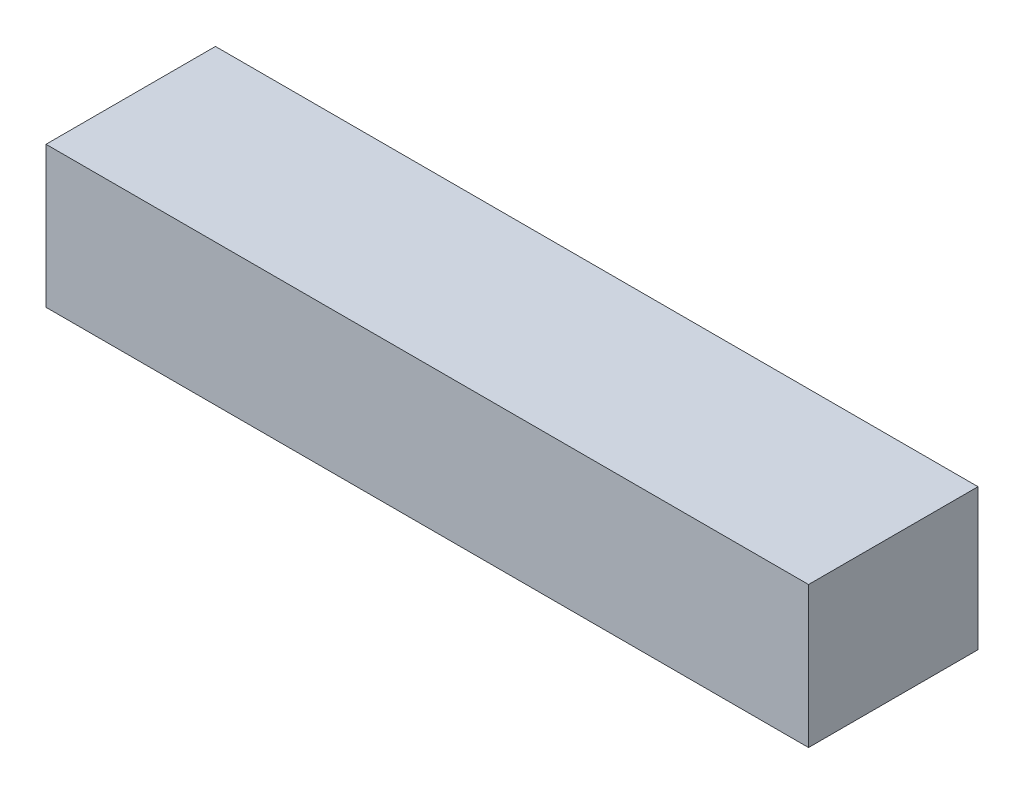
ISO-10303-21;
HEADER;
FILE_DESCRIPTION(('STEP AP214'),'2;1');
FILE_NAME('part.step','',(''),(''),'','','');
FILE_SCHEMA(('AUTOMOTIVE_DESIGN { 1 0 10303 214 1 1 1 1 }'));
ENDSEC;
DATA;
#1=APPLICATION_CONTEXT('core data for automotive mechanical design processes');
#2=APPLICATION_PROTOCOL_DEFINITION('international standard','automotive_design',2000,#1);
#3=PRODUCT_CONTEXT('',#1,'mechanical');
#4=PRODUCT('Part','Part','',(#3));
#5=PRODUCT_RELATED_PRODUCT_CATEGORY('part','',(#4));
#6=PRODUCT_DEFINITION_FORMATION('','',#4);
#7=PRODUCT_DEFINITION_CONTEXT('part definition',#1,'design');
#8=PRODUCT_DEFINITION('design','',#6,#7);
#9=PRODUCT_DEFINITION_SHAPE('','',#8);
#10=(LENGTH_UNIT() NAMED_UNIT(*) SI_UNIT(.MILLI.,.METRE.));
#11=(NAMED_UNIT(*) PLANE_ANGLE_UNIT() SI_UNIT($,.RADIAN.));
#12=(NAMED_UNIT(*) SI_UNIT($,.STERADIAN.) SOLID_ANGLE_UNIT());
#13=UNCERTAINTY_MEASURE_WITH_UNIT(LENGTH_MEASURE(1.E-05),#10,'distance_accuracy_value','');
#14=(GEOMETRIC_REPRESENTATION_CONTEXT(3) GLOBAL_UNCERTAINTY_ASSIGNED_CONTEXT((#13)) GLOBAL_UNIT_ASSIGNED_CONTEXT((#10,
#11,#12)) REPRESENTATION_CONTEXT('',''));
#15=CARTESIAN_POINT('',(0.,0.,0.));
#16=DIRECTION('',(0.,0.,1.));
#17=DIRECTION('',(1.,0.,0.));
#18=AXIS2_PLACEMENT_3D('',#15,#16,#17);
#19=CARTESIAN_POINT('',(0.,5.,0.));
#20=DIRECTION('',(1.,0.,0.));
#21=DIRECTION('',(0.,0.,-1.));
#22=AXIS2_PLACEMENT_3D('',#19,#20,#21);
#23=PLANE('',#22);
#24=DIRECTION('',(0.,0.,1.));
#25=VECTOR('',#24,1.);
#26=CARTESIAN_POINT('',(0.,0.,0.));
#27=LINE('',#26,#25);
#28=CARTESIAN_POINT('',(0.,0.,0.));
#29=VERTEX_POINT('',#28);
#30=CARTESIAN_POINT('',(0.,0.,6.));
#31=VERTEX_POINT('',#30);
#32=EDGE_CURVE('E100',#29,#31,#27,.T.);
#33=ORIENTED_EDGE('',*,*,#32,.T.);
#34=DIRECTION('',(0.,-1.,0.));
#35=VECTOR('',#34,1.);
#36=CARTESIAN_POINT('',(0.,5.,6.));
#37=LINE('',#36,#35);
#38=CARTESIAN_POINT('',(0.,5.,6.));
#39=VERTEX_POINT('',#38);
#40=EDGE_CURVE('E11',#39,#31,#37,.T.);
#41=ORIENTED_EDGE('',*,*,#40,.F.);
#42=DIRECTION('',(0.,0.,1.));
#43=VECTOR('',#42,1.);
#44=CARTESIAN_POINT('',(0.,5.,0.));
#45=LINE('',#44,#43);
#46=CARTESIAN_POINT('',(0.,5.,0.));
#47=VERTEX_POINT('',#46);
#48=EDGE_CURVE('E88',#47,#39,#45,.T.);
#49=ORIENTED_EDGE('',*,*,#48,.F.);
#50=DIRECTION('',(0.,-1.,0.));
#51=VECTOR('',#50,1.);
#52=CARTESIAN_POINT('',(0.,5.,0.));
#53=LINE('',#52,#51);
#54=EDGE_CURVE('E96',#47,#29,#53,.T.);
#55=ORIENTED_EDGE('',*,*,#54,.T.);
#56=EDGE_LOOP('',(#33,#41,#49,#55));
#57=FACE_BOUND('',#56,.T.);
#58=ADVANCED_FACE('F37',(#57),#23,.F.);
#59=CARTESIAN_POINT('',(0.,5.,6.));
#60=DIRECTION('',(0.,0.,-1.));
#61=DIRECTION('',(-1.,0.,0.));
#62=AXIS2_PLACEMENT_3D('',#59,#60,#61);
#63=PLANE('',#62);
#64=DIRECTION('',(1.,0.,0.));
#65=VECTOR('',#64,1.);
#66=CARTESIAN_POINT('',(0.,0.,6.));
#67=LINE('',#66,#65);
#68=CARTESIAN_POINT('',(27.,0.,6.));
#69=VERTEX_POINT('',#68);
#70=EDGE_CURVE('E92',#31,#69,#67,.T.);
#71=ORIENTED_EDGE('',*,*,#70,.T.);
#72=DIRECTION('',(0.,-1.,0.));
#73=VECTOR('',#72,1.);
#74=CARTESIAN_POINT('',(27.,5.,6.));
#75=LINE('',#74,#73);
#76=CARTESIAN_POINT('',(27.,5.,6.));
#77=VERTEX_POINT('',#76);
#78=EDGE_CURVE('E45',#77,#69,#75,.T.);
#79=ORIENTED_EDGE('',*,*,#78,.F.);
#80=DIRECTION('',(1.,0.,0.));
#81=VECTOR('',#80,1.);
#82=CARTESIAN_POINT('',(0.,5.,6.));
#83=LINE('',#82,#81);
#84=EDGE_CURVE('E83',#39,#77,#83,.T.);
#85=ORIENTED_EDGE('',*,*,#84,.F.);
#86=ORIENTED_EDGE('',*,*,#40,.T.);
#87=EDGE_LOOP('',(#71,#79,#85,#86));
#88=FACE_BOUND('',#87,.T.);
#89=ADVANCED_FACE('F91',(#88),#63,.F.);
#90=CARTESIAN_POINT('',(27.,5.,0.));
#91=DIRECTION('',(-1.,0.,0.));
#92=DIRECTION('',(0.,0.,1.));
#93=AXIS2_PLACEMENT_3D('',#90,#91,#92);
#94=PLANE('',#93);
#95=DIRECTION('',(0.,0.,-1.));
#96=VECTOR('',#95,1.);
#97=CARTESIAN_POINT('',(27.,0.,0.));
#98=LINE('',#97,#96);
#99=CARTESIAN_POINT('',(27.,0.,0.));
#100=VERTEX_POINT('',#99);
#101=EDGE_CURVE('E70',#69,#100,#98,.T.);
#102=ORIENTED_EDGE('',*,*,#101,.T.);
#103=DIRECTION('',(0.,-1.,0.));
#104=VECTOR('',#103,1.);
#105=CARTESIAN_POINT('',(27.,5.,0.));
#106=LINE('',#105,#104);
#107=CARTESIAN_POINT('',(27.,5.,0.));
#108=VERTEX_POINT('',#107);
#109=EDGE_CURVE('E93',#108,#100,#106,.T.);
#110=ORIENTED_EDGE('',*,*,#109,.F.);
#111=DIRECTION('',(0.,0.,-1.));
#112=VECTOR('',#111,1.);
#113=CARTESIAN_POINT('',(27.,5.,0.));
#114=LINE('',#113,#112);
#115=EDGE_CURVE('E86',#77,#108,#114,.T.);
#116=ORIENTED_EDGE('',*,*,#115,.F.);
#117=ORIENTED_EDGE('',*,*,#78,.T.);
#118=EDGE_LOOP('',(#102,#110,#116,#117));
#119=FACE_BOUND('',#118,.T.);
#120=ADVANCED_FACE('F94',(#119),#94,.F.);
#121=CARTESIAN_POINT('',(0.,5.,0.));
#122=DIRECTION('',(0.,0.,1.));
#123=DIRECTION('',(1.,0.,0.));
#124=AXIS2_PLACEMENT_3D('',#121,#122,#123);
#125=PLANE('',#124);
#126=DIRECTION('',(-1.,0.,0.));
#127=VECTOR('',#126,1.);
#128=CARTESIAN_POINT('',(0.,0.,0.));
#129=LINE('',#128,#127);
#130=EDGE_CURVE('E76',#100,#29,#129,.T.);
#131=ORIENTED_EDGE('',*,*,#130,.T.);
#132=ORIENTED_EDGE('',*,*,#54,.F.);
#133=DIRECTION('',(-1.,0.,0.));
#134=VECTOR('',#133,1.);
#135=CARTESIAN_POINT('',(0.,5.,0.));
#136=LINE('',#135,#134);
#137=EDGE_CURVE('E53',#108,#47,#136,.T.);
#138=ORIENTED_EDGE('',*,*,#137,.F.);
#139=ORIENTED_EDGE('',*,*,#109,.T.);
#140=EDGE_LOOP('',(#131,#132,#138,#139));
#141=FACE_BOUND('',#140,.T.);
#142=ADVANCED_FACE('F107',(#141),#125,.F.);
#143=CARTESIAN_POINT('',(0.,5.,0.));
#144=DIRECTION('',(0.,1.,0.));
#145=DIRECTION('',(0.,0.,1.));
#146=AXIS2_PLACEMENT_3D('',#143,#144,#145);
#147=PLANE('',#146);
#148=ORIENTED_EDGE('',*,*,#48,.T.);
#149=ORIENTED_EDGE('',*,*,#84,.T.);
#150=ORIENTED_EDGE('',*,*,#115,.T.);
#151=ORIENTED_EDGE('',*,*,#137,.T.);
#152=EDGE_LOOP('',(#148,#149,#150,#151));
#153=FACE_BOUND('',#152,.T.);
#154=ADVANCED_FACE('F84',(#153),#147,.T.);
#155=CARTESIAN_POINT('',(0.,0.,0.));
#156=DIRECTION('',(0.,1.,0.));
#157=DIRECTION('',(0.,0.,1.));
#158=AXIS2_PLACEMENT_3D('',#155,#156,#157);
#159=PLANE('',#158);
#160=ORIENTED_EDGE('',*,*,#32,.F.);
#161=ORIENTED_EDGE('',*,*,#130,.F.);
#162=ORIENTED_EDGE('',*,*,#101,.F.);
#163=ORIENTED_EDGE('',*,*,#70,.F.);
#164=EDGE_LOOP('',(#160,#161,#162,#163));
#165=FACE_BOUND('',#164,.T.);
#166=ADVANCED_FACE('F110',(#165),#159,.F.);
#167=CLOSED_SHELL('',(#58,#89,#120,#142,#154,#166));
#168=MANIFOLD_SOLID_BREP('B2',#167);
#169=ADVANCED_BREP_SHAPE_REPRESENTATION('',(#18,#168),#14);
#170=SHAPE_DEFINITION_REPRESENTATION(#9,#169);
ENDSEC;
END-ISO-10303-21;
